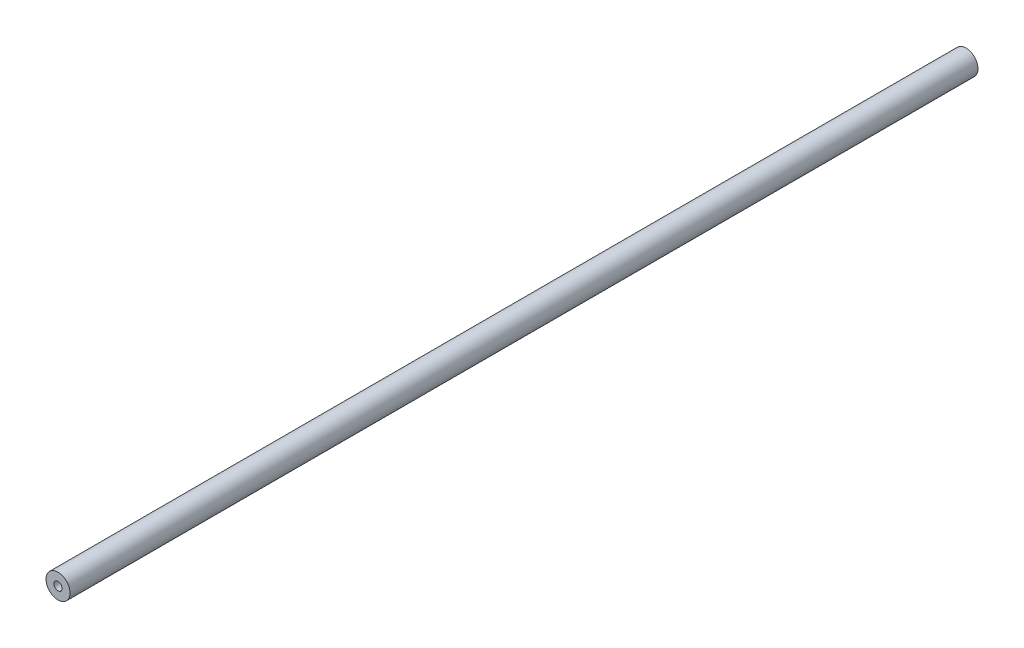
ISO-10303-21;
HEADER;
FILE_DESCRIPTION(('STEP AP214'),'2;1');
FILE_NAME('part.step','',(''),(''),'','','');
FILE_SCHEMA(('AUTOMOTIVE_DESIGN { 1 0 10303 214 1 1 1 1 }'));
ENDSEC;
DATA;
#1=APPLICATION_CONTEXT('core data for automotive mechanical design processes');
#2=APPLICATION_PROTOCOL_DEFINITION('international standard','automotive_design',2000,#1);
#3=PRODUCT_CONTEXT('',#1,'mechanical');
#4=PRODUCT('Part','Part','',(#3));
#5=PRODUCT_RELATED_PRODUCT_CATEGORY('part','',(#4));
#6=PRODUCT_DEFINITION_FORMATION('','',#4);
#7=PRODUCT_DEFINITION_CONTEXT('part definition',#1,'design');
#8=PRODUCT_DEFINITION('design','',#6,#7);
#9=PRODUCT_DEFINITION_SHAPE('','',#8);
#10=(LENGTH_UNIT() NAMED_UNIT(*) SI_UNIT(.MILLI.,.METRE.));
#11=(NAMED_UNIT(*) PLANE_ANGLE_UNIT() SI_UNIT($,.RADIAN.));
#12=(NAMED_UNIT(*) SI_UNIT($,.STERADIAN.) SOLID_ANGLE_UNIT());
#13=UNCERTAINTY_MEASURE_WITH_UNIT(LENGTH_MEASURE(1.E-05),#10,'distance_accuracy_value','');
#14=(GEOMETRIC_REPRESENTATION_CONTEXT(3) GLOBAL_UNCERTAINTY_ASSIGNED_CONTEXT((#13)) GLOBAL_UNIT_ASSIGNED_CONTEXT((#10,
#11,#12)) REPRESENTATION_CONTEXT('',''));
#15=CARTESIAN_POINT('',(0.,0.,0.));
#16=DIRECTION('',(0.,0.,1.));
#17=DIRECTION('',(1.,0.,0.));
#18=AXIS2_PLACEMENT_3D('',#15,#16,#17);
#19=CARTESIAN_POINT('',(0.,0.,-496.955339059328));
#20=DIRECTION('',(0.,0.,1.));
#21=DIRECTION('',(1.,0.,0.));
#22=AXIS2_PLACEMENT_3D('',#19,#20,#21);
#23=CYLINDRICAL_SURFACE('',#22,12.5);
#24=CARTESIAN_POINT('',(0.,0.,10.));
#25=DIRECTION('',(0.,0.,1.));
#26=DIRECTION('',(1.,0.,0.));
#27=AXIS2_PLACEMENT_3D('',#24,#25,#26);
#28=CIRCLE('',#27,12.5);
#29=CARTESIAN_POINT('',(12.5,0.,10.));
#30=VERTEX_POINT('',#29);
#31=EDGE_CURVE('E11',#30,#30,#28,.T.);
#32=ORIENTED_EDGE('',*,*,#31,.F.);
#33=EDGE_LOOP('',(#32));
#34=FACE_BOUND('',#33,.T.);
#35=CARTESIAN_POINT('',(0.,0.,-933.200000000001));
#36=DIRECTION('',(0.,0.,1.));
#37=DIRECTION('',(1.,0.,0.));
#38=AXIS2_PLACEMENT_3D('',#35,#36,#37);
#39=CIRCLE('',#38,12.5);
#40=CARTESIAN_POINT('',(12.5,0.,-933.200000000001));
#41=VERTEX_POINT('',#40);
#42=EDGE_CURVE('E61',#41,#41,#39,.T.);
#43=ORIENTED_EDGE('',*,*,#42,.T.);
#44=EDGE_LOOP('',(#43));
#45=FACE_BOUND('',#44,.T.);
#46=ADVANCED_FACE('F38',(#34,#45),#23,.T.);
#47=CARTESIAN_POINT('',(0.,0.,10.));
#48=DIRECTION('',(0.,0.,1.));
#49=DIRECTION('',(1.,0.,0.));
#50=AXIS2_PLACEMENT_3D('',#47,#48,#49);
#51=PLANE('',#50);
#52=CARTESIAN_POINT('',(0.,0.,10.));
#53=DIRECTION('',(0.,0.,1.));
#54=DIRECTION('',(1.,0.,0.));
#55=AXIS2_PLACEMENT_3D('',#52,#53,#54);
#56=CIRCLE('',#55,4.24999999999999);
#57=CARTESIAN_POINT('',(4.24999999999999,0.,10.));
#58=VERTEX_POINT('',#57);
#59=EDGE_CURVE('E65',#58,#58,#56,.T.);
#60=ORIENTED_EDGE('',*,*,#59,.F.);
#61=EDGE_LOOP('',(#60));
#62=FACE_BOUND('',#61,.T.);
#63=ORIENTED_EDGE('',*,*,#31,.T.);
#64=EDGE_LOOP('',(#63));
#65=FACE_BOUND('',#64,.T.);
#66=ADVANCED_FACE('F82',(#62,#65),#51,.T.);
#67=CARTESIAN_POINT('',(0.,0.,-17.5));
#68=DIRECTION('',(0.,0.,1.));
#69=DIRECTION('',(1.,0.,0.));
#70=AXIS2_PLACEMENT_3D('',#67,#68,#69);
#71=CONICAL_SURFACE('',#70,4.24999999999999,1.02974425867665);
#72=CARTESIAN_POINT('',(0.,0.,-20.0536576308671));
#73=VERTEX_POINT('',#72);
#74=VERTEX_LOOP('',#73);
#75=FACE_BOUND('',#74,.T.);
#76=CARTESIAN_POINT('',(0.,0.,-17.5));
#77=DIRECTION('',(0.,0.,1.));
#78=DIRECTION('',(1.,0.,0.));
#79=AXIS2_PLACEMENT_3D('',#76,#77,#78);
#80=CIRCLE('',#79,4.24999999999999);
#81=CARTESIAN_POINT('',(4.24999999999999,0.,-17.5));
#82=VERTEX_POINT('',#81);
#83=EDGE_CURVE('E45',#82,#82,#80,.T.);
#84=ORIENTED_EDGE('',*,*,#83,.T.);
#85=EDGE_LOOP('',(#84));
#86=FACE_BOUND('',#85,.T.);
#87=ADVANCED_FACE('F74',(#75,#86),#71,.F.);
#88=CARTESIAN_POINT('',(0.,0.,10.));
#89=DIRECTION('',(0.,0.,1.));
#90=DIRECTION('',(1.,0.,0.));
#91=AXIS2_PLACEMENT_3D('',#88,#89,#90);
#92=CYLINDRICAL_SURFACE('',#91,4.24999999999999);
#93=ORIENTED_EDGE('',*,*,#83,.F.);
#94=EDGE_LOOP('',(#93));
#95=FACE_BOUND('',#94,.T.);
#96=ORIENTED_EDGE('',*,*,#59,.T.);
#97=EDGE_LOOP('',(#96));
#98=FACE_BOUND('',#97,.T.);
#99=ADVANCED_FACE('F76',(#95,#98),#92,.F.);
#100=CARTESIAN_POINT('',(0.,0.,-933.200000000001));
#101=DIRECTION('',(0.,0.,-1.));
#102=DIRECTION('',(1.,0.,0.));
#103=AXIS2_PLACEMENT_3D('',#100,#101,#102);
#104=PLANE('',#103);
#105=CARTESIAN_POINT('',(0.,0.,-933.200000000001));
#106=DIRECTION('',(0.,0.,1.));
#107=DIRECTION('',(1.,0.,0.));
#108=AXIS2_PLACEMENT_3D('',#105,#106,#107);
#109=CIRCLE('',#108,4.24999999999999);
#110=CARTESIAN_POINT('',(4.24999999999999,0.,-933.200000000001));
#111=VERTEX_POINT('',#110);
#112=EDGE_CURVE('E62',#111,#111,#109,.T.);
#113=ORIENTED_EDGE('',*,*,#112,.T.);
#114=EDGE_LOOP('',(#113));
#115=FACE_BOUND('',#114,.T.);
#116=ORIENTED_EDGE('',*,*,#42,.F.);
#117=EDGE_LOOP('',(#116));
#118=FACE_BOUND('',#117,.T.);
#119=ADVANCED_FACE('F55',(#115,#118),#104,.T.);
#120=CARTESIAN_POINT('',(0.,0.,-905.700000000001));
#121=DIRECTION('',(0.,0.,-1.));
#122=DIRECTION('',(1.,0.,0.));
#123=AXIS2_PLACEMENT_3D('',#120,#121,#122);
#124=CONICAL_SURFACE('',#123,4.24999999999999,1.02974425867665);
#125=CARTESIAN_POINT('',(0.,0.,-903.146342369133));
#126=VERTEX_POINT('',#125);
#127=VERTEX_LOOP('',#126);
#128=FACE_BOUND('',#127,.T.);
#129=CARTESIAN_POINT('',(0.,0.,-905.700000000001));
#130=DIRECTION('',(0.,0.,1.));
#131=DIRECTION('',(1.,0.,0.));
#132=AXIS2_PLACEMENT_3D('',#129,#130,#131);
#133=CIRCLE('',#132,4.24999999999999);
#134=CARTESIAN_POINT('',(4.24999999999999,0.,-905.700000000001));
#135=VERTEX_POINT('',#134);
#136=EDGE_CURVE('E59',#135,#135,#133,.T.);
#137=ORIENTED_EDGE('',*,*,#136,.F.);
#138=EDGE_LOOP('',(#137));
#139=FACE_BOUND('',#138,.T.);
#140=ADVANCED_FACE('F51',(#128,#139),#124,.F.);
#141=CARTESIAN_POINT('',(0.,0.,-933.200000000001));
#142=DIRECTION('',(0.,0.,-1.));
#143=DIRECTION('',(1.,0.,0.));
#144=AXIS2_PLACEMENT_3D('',#141,#142,#143);
#145=CYLINDRICAL_SURFACE('',#144,4.24999999999999);
#146=ORIENTED_EDGE('',*,*,#136,.T.);
#147=EDGE_LOOP('',(#146));
#148=FACE_BOUND('',#147,.T.);
#149=ORIENTED_EDGE('',*,*,#112,.F.);
#150=EDGE_LOOP('',(#149));
#151=FACE_BOUND('',#150,.T.);
#152=ADVANCED_FACE('F54',(#148,#151),#145,.F.);
#153=CLOSED_SHELL('',(#46,#66,#87,#99,#119,#140,#152));
#154=MANIFOLD_SOLID_BREP('B2',#153);
#155=ADVANCED_BREP_SHAPE_REPRESENTATION('',(#18,#154),#14);
#156=SHAPE_DEFINITION_REPRESENTATION(#9,#155);
ENDSEC;
END-ISO-10303-21;
